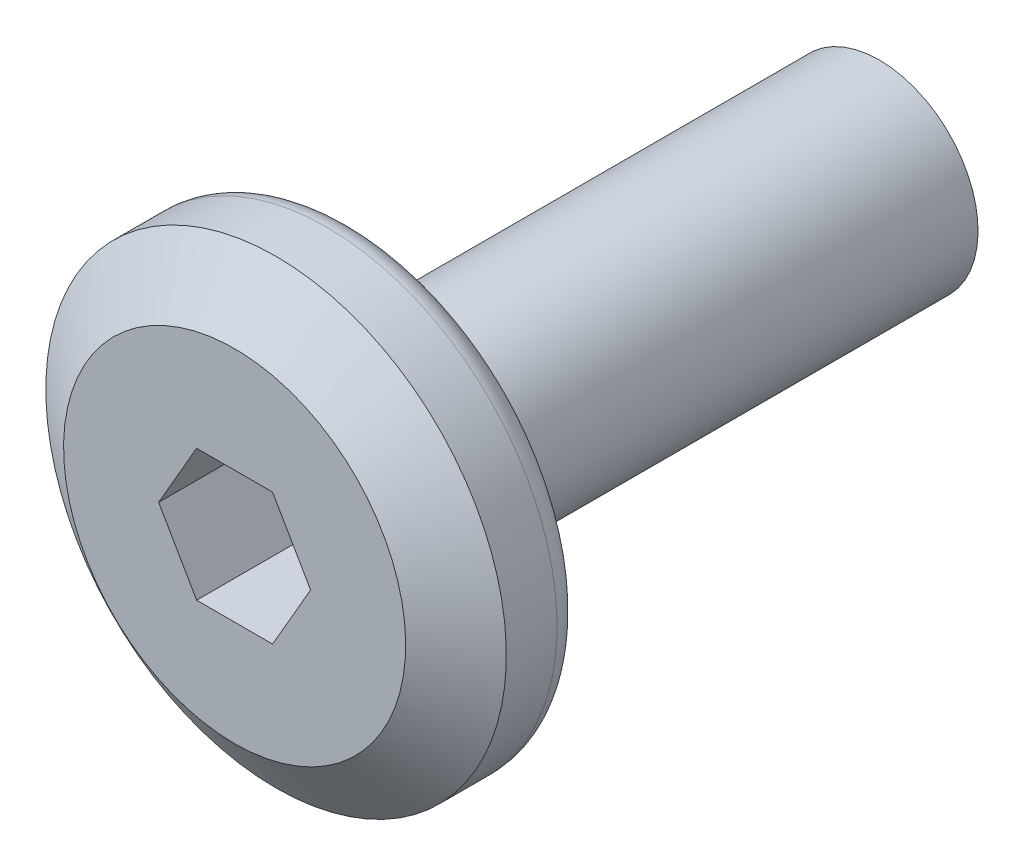
ISO-10303-21;
HEADER;
FILE_DESCRIPTION(('STEP AP214'),'2;1');
FILE_NAME('part.step','',(''),(''),'','','');
FILE_SCHEMA(('AUTOMOTIVE_DESIGN { 1 0 10303 214 1 1 1 1 }'));
ENDSEC;
DATA;
#1=APPLICATION_CONTEXT('core data for automotive mechanical design processes');
#2=APPLICATION_PROTOCOL_DEFINITION('international standard','automotive_design',2000,#1);
#3=PRODUCT_CONTEXT('',#1,'mechanical');
#4=PRODUCT('Part','Part','',(#3));
#5=PRODUCT_RELATED_PRODUCT_CATEGORY('part','',(#4));
#6=PRODUCT_DEFINITION_FORMATION('','',#4);
#7=PRODUCT_DEFINITION_CONTEXT('part definition',#1,'design');
#8=PRODUCT_DEFINITION('design','',#6,#7);
#9=PRODUCT_DEFINITION_SHAPE('','',#8);
#10=(LENGTH_UNIT() NAMED_UNIT(*) SI_UNIT(.MILLI.,.METRE.));
#11=(NAMED_UNIT(*) PLANE_ANGLE_UNIT() SI_UNIT($,.RADIAN.));
#12=(NAMED_UNIT(*) SI_UNIT($,.STERADIAN.) SOLID_ANGLE_UNIT());
#13=UNCERTAINTY_MEASURE_WITH_UNIT(LENGTH_MEASURE(1.E-05),#10,'distance_accuracy_value','');
#14=(GEOMETRIC_REPRESENTATION_CONTEXT(3) GLOBAL_UNCERTAINTY_ASSIGNED_CONTEXT((#13)) GLOBAL_UNIT_ASSIGNED_CONTEXT((#10,
#11,#12)) REPRESENTATION_CONTEXT('',''));
#15=CARTESIAN_POINT('',(0.,0.,0.));
#16=DIRECTION('',(0.,0.,1.));
#17=DIRECTION('',(1.,0.,0.));
#18=AXIS2_PLACEMENT_3D('',#15,#16,#17);
#19=CARTESIAN_POINT('',(0.,0.,0.));
#20=DIRECTION('',(0.,0.,1.));
#21=DIRECTION('',(0.,-1.,0.));
#22=AXIS2_PLACEMENT_3D('',#19,#20,#21);
#23=PLANE('',#22);
#24=DIRECTION('',(-0.5,0.866025403784438,0.));
#25=VECTOR('',#24,1.);
#26=CARTESIAN_POINT('',(1.15470053837925,0.,0.));
#27=LINE('',#26,#25);
#28=CARTESIAN_POINT('',(1.15470053837925,0.,0.));
#29=VERTEX_POINT('',#28);
#30=CARTESIAN_POINT('',(0.577350269189626,1.,0.));
#31=VERTEX_POINT('',#30);
#32=EDGE_CURVE('E55',#29,#31,#27,.T.);
#33=ORIENTED_EDGE('',*,*,#32,.F.);
#34=DIRECTION('',(0.5,0.866025403784438,0.));
#35=VECTOR('',#34,1.);
#36=CARTESIAN_POINT('',(0.577350269189626,-1.,0.));
#37=LINE('',#36,#35);
#38=CARTESIAN_POINT('',(0.577350269189626,-1.,0.));
#39=VERTEX_POINT('',#38);
#40=EDGE_CURVE('E138',#39,#29,#37,.T.);
#41=ORIENTED_EDGE('',*,*,#40,.F.);
#42=DIRECTION('',(1.,0.,0.));
#43=VECTOR('',#42,1.);
#44=CARTESIAN_POINT('',(-0.577350269189626,-1.,0.));
#45=LINE('',#44,#43);
#46=CARTESIAN_POINT('',(-0.577350269189626,-1.,0.));
#47=VERTEX_POINT('',#46);
#48=EDGE_CURVE('E136',#47,#39,#45,.T.);
#49=ORIENTED_EDGE('',*,*,#48,.F.);
#50=DIRECTION('',(0.5,-0.866025403784439,0.));
#51=VECTOR('',#50,1.);
#52=CARTESIAN_POINT('',(-1.15470053837925,0.,0.));
#53=LINE('',#52,#51);
#54=CARTESIAN_POINT('',(-1.15470053837925,0.,0.));
#55=VERTEX_POINT('',#54);
#56=EDGE_CURVE('E103',#55,#47,#53,.T.);
#57=ORIENTED_EDGE('',*,*,#56,.F.);
#58=DIRECTION('',(-0.5,-0.866025403784439,0.));
#59=VECTOR('',#58,1.);
#60=CARTESIAN_POINT('',(-0.577350269189626,1.,0.));
#61=LINE('',#60,#59);
#62=CARTESIAN_POINT('',(-0.577350269189626,1.,0.));
#63=VERTEX_POINT('',#62);
#64=EDGE_CURVE('E132',#63,#55,#61,.T.);
#65=ORIENTED_EDGE('',*,*,#64,.F.);
#66=DIRECTION('',(-1.,0.,0.));
#67=VECTOR('',#66,1.);
#68=CARTESIAN_POINT('',(0.577350269189626,1.,0.));
#69=LINE('',#68,#67);
#70=EDGE_CURVE('E129',#31,#63,#69,.T.);
#71=ORIENTED_EDGE('',*,*,#70,.F.);
#72=EDGE_LOOP('',(#33,#41,#49,#57,#65,#71));
#73=FACE_BOUND('',#72,.T.);
#74=CARTESIAN_POINT('',(0.,0.,0.));
#75=DIRECTION('',(0.,0.,1.));
#76=DIRECTION('',(0.,-1.,0.));
#77=AXIS2_PLACEMENT_3D('',#74,#75,#76);
#78=CIRCLE('',#77,2.59999999999999);
#79=CARTESIAN_POINT('',(0.,-2.59999999999999,0.));
#80=VERTEX_POINT('',#79);
#81=EDGE_CURVE('E156',#80,#80,#78,.T.);
#82=ORIENTED_EDGE('',*,*,#81,.T.);
#83=EDGE_LOOP('',(#82));
#84=FACE_BOUND('',#83,.T.);
#85=ADVANCED_FACE('F40',(#73,#84),#23,.T.);
#86=CARTESIAN_POINT('',(0.,0.,-9.8));
#87=DIRECTION('',(0.,0.,-1.));
#88=DIRECTION('',(0.,1.,0.));
#89=AXIS2_PLACEMENT_3D('',#86,#87,#88);
#90=CYLINDRICAL_SURFACE('',#89,3.5);
#91=CARTESIAN_POINT('',(0.,0.,-1.4));
#92=DIRECTION('',(0.,0.,-1.));
#93=DIRECTION('',(0.,1.,0.));
#94=AXIS2_PLACEMENT_3D('',#91,#92,#93);
#95=CIRCLE('',#94,3.5);
#96=CARTESIAN_POINT('',(0.,3.5,-1.4));
#97=VERTEX_POINT('',#96);
#98=EDGE_CURVE('E11',#97,#97,#95,.F.);
#99=ORIENTED_EDGE('',*,*,#98,.T.);
#100=EDGE_LOOP('',(#99));
#101=FACE_BOUND('',#100,.T.);
#102=CARTESIAN_POINT('',(0.,0.,-0.630186784388741));
#103=DIRECTION('',(0.,0.,1.));
#104=DIRECTION('',(0.,-1.,0.));
#105=AXIS2_PLACEMENT_3D('',#102,#103,#104);
#106=CIRCLE('',#105,3.5);
#107=CARTESIAN_POINT('',(0.,-3.5,-0.630186784388742));
#108=VERTEX_POINT('',#107);
#109=EDGE_CURVE('E153',#108,#108,#106,.F.);
#110=ORIENTED_EDGE('',*,*,#109,.T.);
#111=EDGE_LOOP('',(#110));
#112=FACE_BOUND('',#111,.T.);
#113=ADVANCED_FACE('F173',(#101,#112),#90,.T.);
#114=CARTESIAN_POINT('',(0.,3.5,-1.8));
#115=DIRECTION('',(0.,0.,-1.));
#116=DIRECTION('',(0.,1.,0.));
#117=AXIS2_PLACEMENT_3D('',#114,#115,#116);
#118=PLANE('',#117);
#119=CARTESIAN_POINT('',(0.,0.,-1.8));
#120=DIRECTION('',(0.,0.,-1.));
#121=DIRECTION('',(0.,1.,0.));
#122=AXIS2_PLACEMENT_3D('',#119,#120,#121);
#123=CIRCLE('',#122,3.1);
#124=CARTESIAN_POINT('',(0.,3.1,-1.8));
#125=VERTEX_POINT('',#124);
#126=EDGE_CURVE('E48',#125,#125,#123,.T.);
#127=ORIENTED_EDGE('',*,*,#126,.T.);
#128=EDGE_LOOP('',(#127));
#129=FACE_BOUND('',#128,.T.);
#130=CARTESIAN_POINT('',(0.,0.,-1.8));
#131=DIRECTION('',(0.,0.,-1.));
#132=DIRECTION('',(0.,1.,0.));
#133=AXIS2_PLACEMENT_3D('',#130,#131,#132);
#134=CIRCLE('',#133,1.5);
#135=CARTESIAN_POINT('',(0.,1.5,-1.8));
#136=VERTEX_POINT('',#135);
#137=EDGE_CURVE('E150',#136,#136,#134,.T.);
#138=ORIENTED_EDGE('',*,*,#137,.F.);
#139=EDGE_LOOP('',(#138));
#140=FACE_BOUND('',#139,.T.);
#141=ADVANCED_FACE('F161',(#129,#140),#118,.T.);
#142=CARTESIAN_POINT('',(0.,0.,-9.8));
#143=DIRECTION('',(0.,0.,-1.));
#144=DIRECTION('',(0.,1.,0.));
#145=AXIS2_PLACEMENT_3D('',#142,#143,#144);
#146=CYLINDRICAL_SURFACE('',#145,1.5);
#147=ORIENTED_EDGE('',*,*,#137,.T.);
#148=EDGE_LOOP('',(#147));
#149=FACE_BOUND('',#148,.T.);
#150=CARTESIAN_POINT('',(0.,0.,-9.8));
#151=DIRECTION('',(0.,0.,-1.));
#152=DIRECTION('',(0.,1.,0.));
#153=AXIS2_PLACEMENT_3D('',#150,#151,#152);
#154=CIRCLE('',#153,1.5);
#155=CARTESIAN_POINT('',(0.,1.5,-9.8));
#156=VERTEX_POINT('',#155);
#157=EDGE_CURVE('E142',#156,#156,#154,.T.);
#158=ORIENTED_EDGE('',*,*,#157,.F.);
#159=EDGE_LOOP('',(#158));
#160=FACE_BOUND('',#159,.T.);
#161=ADVANCED_FACE('F197',(#149,#160),#146,.T.);
#162=CARTESIAN_POINT('',(0.,1.5,-9.8));
#163=DIRECTION('',(0.,0.,-1.));
#164=DIRECTION('',(0.,1.,0.));
#165=AXIS2_PLACEMENT_3D('',#162,#163,#164);
#166=PLANE('',#165);
#167=ORIENTED_EDGE('',*,*,#157,.T.);
#168=EDGE_LOOP('',(#167));
#169=FACE_BOUND('',#168,.T.);
#170=ADVANCED_FACE('F189',(#169),#166,.T.);
#171=CARTESIAN_POINT('',(0.,0.,-0.630186784388741));
#172=DIRECTION('',(0.,0.,-1.));
#173=DIRECTION('',(0.,1.,0.));
#174=AXIS2_PLACEMENT_3D('',#171,#172,#173);
#175=CONICAL_SURFACE('',#174,3.5,0.959931088596882);
#176=ORIENTED_EDGE('',*,*,#81,.F.);
#177=EDGE_LOOP('',(#176));
#178=FACE_BOUND('',#177,.T.);
#179=ORIENTED_EDGE('',*,*,#109,.F.);
#180=EDGE_LOOP('',(#179));
#181=FACE_BOUND('',#180,.T.);
#182=ADVANCED_FACE('F184',(#178,#181),#175,.T.);
#183=CARTESIAN_POINT('',(1.15470053837925,0.,-1.5));
#184=DIRECTION('',(0.866025403784439,0.5,0.));
#185=DIRECTION('',(-0.5,0.866025403784439,0.));
#186=AXIS2_PLACEMENT_3D('',#183,#184,#185);
#187=PLANE('',#186);
#188=ORIENTED_EDGE('',*,*,#32,.T.);
#189=DIRECTION('',(0.,0.,1.));
#190=VECTOR('',#189,1.);
#191=CARTESIAN_POINT('',(0.577350269189626,1.,-1.5));
#192=LINE('',#191,#190);
#193=CARTESIAN_POINT('',(0.577350269189626,1.,-1.5));
#194=VERTEX_POINT('',#193);
#195=EDGE_CURVE('E85',#194,#31,#192,.T.);
#196=ORIENTED_EDGE('',*,*,#195,.F.);
#197=DIRECTION('',(-0.5,0.866025403784438,0.));
#198=VECTOR('',#197,1.);
#199=CARTESIAN_POINT('',(1.15470053837925,0.,-1.5));
#200=LINE('',#199,#198);
#201=CARTESIAN_POINT('',(1.15470053837925,0.,-1.5));
#202=VERTEX_POINT('',#201);
#203=EDGE_CURVE('E140',#202,#194,#200,.T.);
#204=ORIENTED_EDGE('',*,*,#203,.F.);
#205=DIRECTION('',(0.,0.,1.));
#206=VECTOR('',#205,1.);
#207=CARTESIAN_POINT('',(1.15470053837925,0.,-1.5));
#208=LINE('',#207,#206);
#209=EDGE_CURVE('E63',#202,#29,#208,.T.);
#210=ORIENTED_EDGE('',*,*,#209,.T.);
#211=EDGE_LOOP('',(#188,#196,#204,#210));
#212=FACE_BOUND('',#211,.T.);
#213=ADVANCED_FACE('F188',(#212),#187,.F.);
#214=CARTESIAN_POINT('',(0.577350269189626,-1.,-1.5));
#215=DIRECTION('',(0.866025403784439,-0.5,0.));
#216=DIRECTION('',(0.5,0.866025403784439,0.));
#217=AXIS2_PLACEMENT_3D('',#214,#215,#216);
#218=PLANE('',#217);
#219=ORIENTED_EDGE('',*,*,#40,.T.);
#220=ORIENTED_EDGE('',*,*,#209,.F.);
#221=DIRECTION('',(0.5,0.866025403784438,0.));
#222=VECTOR('',#221,1.);
#223=CARTESIAN_POINT('',(0.577350269189626,-1.,-1.5));
#224=LINE('',#223,#222);
#225=CARTESIAN_POINT('',(0.577350269189626,-1.,-1.5));
#226=VERTEX_POINT('',#225);
#227=EDGE_CURVE('E115',#226,#202,#224,.T.);
#228=ORIENTED_EDGE('',*,*,#227,.F.);
#229=DIRECTION('',(0.,0.,1.));
#230=VECTOR('',#229,1.);
#231=CARTESIAN_POINT('',(0.577350269189626,-1.,-1.5));
#232=LINE('',#231,#230);
#233=EDGE_CURVE('E107',#226,#39,#232,.T.);
#234=ORIENTED_EDGE('',*,*,#233,.T.);
#235=EDGE_LOOP('',(#219,#220,#228,#234));
#236=FACE_BOUND('',#235,.T.);
#237=ADVANCED_FACE('F195',(#236),#218,.F.);
#238=CARTESIAN_POINT('',(-0.577350269189626,-1.,-1.5));
#239=DIRECTION('',(0.,-1.,0.));
#240=DIRECTION('',(1.,0.,0.));
#241=AXIS2_PLACEMENT_3D('',#238,#239,#240);
#242=PLANE('',#241);
#243=ORIENTED_EDGE('',*,*,#48,.T.);
#244=ORIENTED_EDGE('',*,*,#233,.F.);
#245=DIRECTION('',(1.,0.,0.));
#246=VECTOR('',#245,1.);
#247=CARTESIAN_POINT('',(-0.577350269189626,-1.,-1.5));
#248=LINE('',#247,#246);
#249=CARTESIAN_POINT('',(-0.577350269189626,-1.,-1.5));
#250=VERTEX_POINT('',#249);
#251=EDGE_CURVE('E111',#250,#226,#248,.T.);
#252=ORIENTED_EDGE('',*,*,#251,.F.);
#253=DIRECTION('',(0.,0.,1.));
#254=VECTOR('',#253,1.);
#255=CARTESIAN_POINT('',(-0.577350269189626,-1.,-1.5));
#256=LINE('',#255,#254);
#257=EDGE_CURVE('E96',#250,#47,#256,.T.);
#258=ORIENTED_EDGE('',*,*,#257,.T.);
#259=EDGE_LOOP('',(#243,#244,#252,#258));
#260=FACE_BOUND('',#259,.T.);
#261=ADVANCED_FACE('F112',(#260),#242,.F.);
#262=CARTESIAN_POINT('',(-1.15470053837925,0.,-1.5));
#263=DIRECTION('',(-0.866025403784439,-0.5,0.));
#264=DIRECTION('',(0.5,-0.866025403784439,0.));
#265=AXIS2_PLACEMENT_3D('',#262,#263,#264);
#266=PLANE('',#265);
#267=ORIENTED_EDGE('',*,*,#56,.T.);
#268=ORIENTED_EDGE('',*,*,#257,.F.);
#269=DIRECTION('',(0.5,-0.866025403784439,0.));
#270=VECTOR('',#269,1.);
#271=CARTESIAN_POINT('',(-1.15470053837925,0.,-1.5));
#272=LINE('',#271,#270);
#273=CARTESIAN_POINT('',(-1.15470053837925,0.,-1.5));
#274=VERTEX_POINT('',#273);
#275=EDGE_CURVE('E100',#274,#250,#272,.T.);
#276=ORIENTED_EDGE('',*,*,#275,.F.);
#277=DIRECTION('',(0.,0.,1.));
#278=VECTOR('',#277,1.);
#279=CARTESIAN_POINT('',(-1.15470053837925,0.,-1.5));
#280=LINE('',#279,#278);
#281=EDGE_CURVE('E108',#274,#55,#280,.T.);
#282=ORIENTED_EDGE('',*,*,#281,.T.);
#283=EDGE_LOOP('',(#267,#268,#276,#282));
#284=FACE_BOUND('',#283,.T.);
#285=ADVANCED_FACE('F98',(#284),#266,.F.);
#286=CARTESIAN_POINT('',(-0.577350269189626,1.,-1.5));
#287=DIRECTION('',(-0.866025403784439,0.5,0.));
#288=DIRECTION('',(-0.5,-0.866025403784439,0.));
#289=AXIS2_PLACEMENT_3D('',#286,#287,#288);
#290=PLANE('',#289);
#291=ORIENTED_EDGE('',*,*,#64,.T.);
#292=ORIENTED_EDGE('',*,*,#281,.F.);
#293=DIRECTION('',(-0.5,-0.866025403784439,0.));
#294=VECTOR('',#293,1.);
#295=CARTESIAN_POINT('',(-0.577350269189626,1.,-1.5));
#296=LINE('',#295,#294);
#297=CARTESIAN_POINT('',(-0.577350269189626,1.,-1.5));
#298=VERTEX_POINT('',#297);
#299=EDGE_CURVE('E121',#298,#274,#296,.T.);
#300=ORIENTED_EDGE('',*,*,#299,.F.);
#301=DIRECTION('',(0.,0.,1.));
#302=VECTOR('',#301,1.);
#303=CARTESIAN_POINT('',(-0.577350269189626,1.,-1.5));
#304=LINE('',#303,#302);
#305=EDGE_CURVE('E145',#298,#63,#304,.T.);
#306=ORIENTED_EDGE('',*,*,#305,.T.);
#307=EDGE_LOOP('',(#291,#292,#300,#306));
#308=FACE_BOUND('',#307,.T.);
#309=ADVANCED_FACE('F267',(#308),#290,.F.);
#310=CARTESIAN_POINT('',(0.577350269189626,1.,-1.5));
#311=DIRECTION('',(0.,1.,0.));
#312=DIRECTION('',(0.,0.,1.));
#313=AXIS2_PLACEMENT_3D('',#310,#311,#312);
#314=PLANE('',#313);
#315=ORIENTED_EDGE('',*,*,#70,.T.);
#316=ORIENTED_EDGE('',*,*,#305,.F.);
#317=DIRECTION('',(-1.,0.,0.));
#318=VECTOR('',#317,1.);
#319=CARTESIAN_POINT('',(0.577350269189626,1.,-1.5));
#320=LINE('',#319,#318);
#321=EDGE_CURVE('E123',#194,#298,#320,.T.);
#322=ORIENTED_EDGE('',*,*,#321,.F.);
#323=ORIENTED_EDGE('',*,*,#195,.T.);
#324=EDGE_LOOP('',(#315,#316,#322,#323));
#325=FACE_BOUND('',#324,.T.);
#326=ADVANCED_FACE('F169',(#325),#314,.F.);
#327=CARTESIAN_POINT('',(0.,0.,-1.5));
#328=DIRECTION('',(0.,0.,1.));
#329=DIRECTION('',(1.,0.,0.));
#330=AXIS2_PLACEMENT_3D('',#327,#328,#329);
#331=PLANE('',#330);
#332=ORIENTED_EDGE('',*,*,#203,.T.);
#333=ORIENTED_EDGE('',*,*,#321,.T.);
#334=ORIENTED_EDGE('',*,*,#299,.T.);
#335=ORIENTED_EDGE('',*,*,#275,.T.);
#336=ORIENTED_EDGE('',*,*,#251,.T.);
#337=ORIENTED_EDGE('',*,*,#227,.T.);
#338=EDGE_LOOP('',(#332,#333,#334,#335,#336,#337));
#339=FACE_BOUND('',#338,.T.);
#340=ADVANCED_FACE('F118',(#339),#331,.T.);
#341=CARTESIAN_POINT('',(0.,0.,-1.4));
#342=DIRECTION('',(0.,0.,-1.));
#343=DIRECTION('',(0.,1.,0.));
#344=AXIS2_PLACEMENT_3D('',#341,#342,#343);
#345=TOROIDAL_SURFACE('',#344,3.1,0.4);
#346=ORIENTED_EDGE('',*,*,#98,.F.);
#347=EDGE_LOOP('',(#346));
#348=FACE_BOUND('',#347,.T.);
#349=ORIENTED_EDGE('',*,*,#126,.F.);
#350=EDGE_LOOP('',(#349));
#351=FACE_BOUND('',#350,.T.);
#352=ADVANCED_FACE('F42',(#348,#351),#345,.T.);
#353=CLOSED_SHELL('',(#85,#113,#141,#161,#170,#182,#213,#237,#261,#285,#309,#326,#340,#352));
#354=MANIFOLD_SOLID_BREP('B2',#353);
#355=ADVANCED_BREP_SHAPE_REPRESENTATION('',(#18,#354),#14);
#356=SHAPE_DEFINITION_REPRESENTATION(#9,#355);
ENDSEC;
END-ISO-10303-21;
